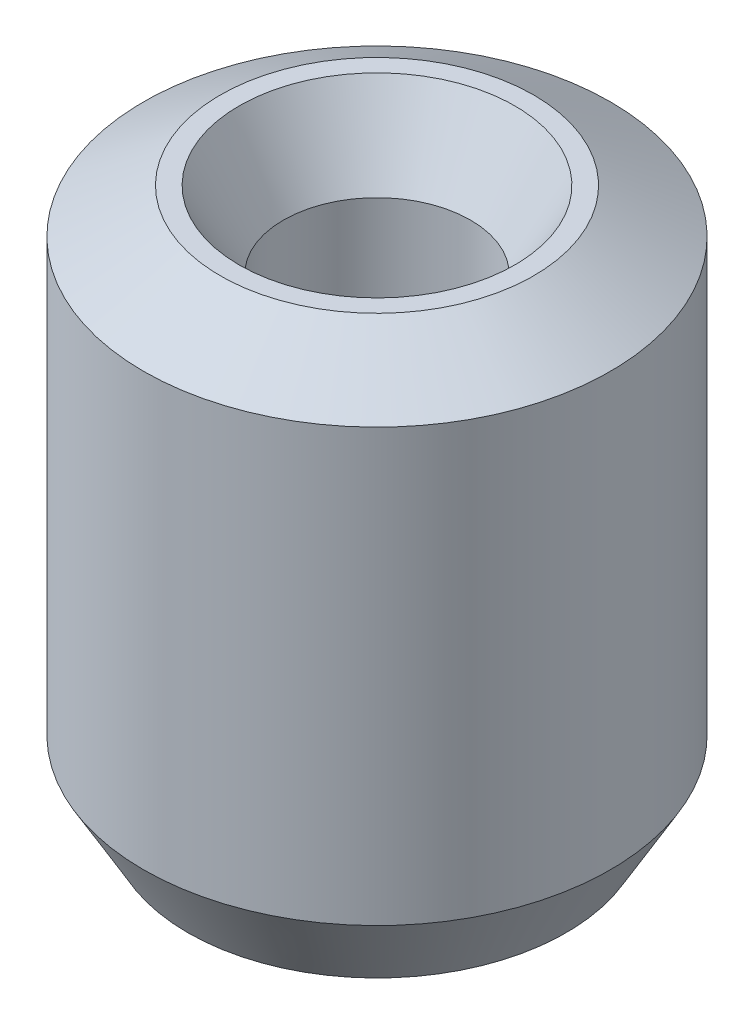
ISO-10303-21;
HEADER;
FILE_DESCRIPTION(('STEP AP214'),'2;1');
FILE_NAME('part.step','',(''),(''),'','','');
FILE_SCHEMA(('AUTOMOTIVE_DESIGN { 1 0 10303 214 1 1 1 1 }'));
ENDSEC;
DATA;
#1=APPLICATION_CONTEXT('core data for automotive mechanical design processes');
#2=APPLICATION_PROTOCOL_DEFINITION('international standard','automotive_design',2000,#1);
#3=PRODUCT_CONTEXT('',#1,'mechanical');
#4=PRODUCT('Part','Part','',(#3));
#5=PRODUCT_RELATED_PRODUCT_CATEGORY('part','',(#4));
#6=PRODUCT_DEFINITION_FORMATION('','',#4);
#7=PRODUCT_DEFINITION_CONTEXT('part definition',#1,'design');
#8=PRODUCT_DEFINITION('design','',#6,#7);
#9=PRODUCT_DEFINITION_SHAPE('','',#8);
#10=(LENGTH_UNIT() NAMED_UNIT(*) SI_UNIT(.MILLI.,.METRE.));
#11=(NAMED_UNIT(*) PLANE_ANGLE_UNIT() SI_UNIT($,.RADIAN.));
#12=(NAMED_UNIT(*) SI_UNIT($,.STERADIAN.) SOLID_ANGLE_UNIT());
#13=UNCERTAINTY_MEASURE_WITH_UNIT(LENGTH_MEASURE(1.E-05),#10,'distance_accuracy_value','');
#14=(GEOMETRIC_REPRESENTATION_CONTEXT(3) GLOBAL_UNCERTAINTY_ASSIGNED_CONTEXT((#13)) GLOBAL_UNIT_ASSIGNED_CONTEXT((#10,
#11,#12)) REPRESENTATION_CONTEXT('',''));
#15=CARTESIAN_POINT('',(0.,0.,0.));
#16=DIRECTION('',(0.,0.,1.));
#17=DIRECTION('',(1.,0.,0.));
#18=AXIS2_PLACEMENT_3D('',#15,#16,#17);
#19=CARTESIAN_POINT('',(0.,23.6784425008133,0.));
#20=DIRECTION('',(0.,-1.,0.));
#21=DIRECTION('',(0.,0.,-1.));
#22=AXIS2_PLACEMENT_3D('',#19,#20,#21);
#23=CYLINDRICAL_SURFACE('',#22,10.);
#24=CARTESIAN_POINT('',(0.,3.28796178943945,0.));
#25=DIRECTION('',(0.,1.,0.));
#26=DIRECTION('',(0.,0.,1.));
#27=AXIS2_PLACEMENT_3D('',#24,#25,#26);
#28=CIRCLE('',#27,10.);
#29=CARTESIAN_POINT('',(0.,3.28796178943945,-10.));
#30=VERTEX_POINT('',#29);
#31=EDGE_CURVE('E10',#30,#30,#28,.T.);
#32=CARTESIAN_POINT('',(0.,21.7801368765953,0.));
#33=DIRECTION('',(0.,1.,0.));
#34=DIRECTION('',(0.,0.,1.));
#35=AXIS2_PLACEMENT_3D('',#32,#33,#34);
#36=CIRCLE('',#35,10.);
#37=CARTESIAN_POINT('',(0.,21.7801368765953,-10.));
#38=VERTEX_POINT('',#37);
#39=EDGE_CURVE('E50',#38,#38,#36,.F.);
#40=CARTESIAN_POINT('',(0.,3.28796178943945,-10.));
#41=CARTESIAN_POINT('',(0.,3.48058861326399,-10.));
#42=CARTESIAN_POINT('',(0.,3.67321543708853,-10.));
#43=CARTESIAN_POINT('',(0.,4.05846908473761,-10.));
#44=CARTESIAN_POINT('',(0.,4.25109590856215,-10.));
#45=CARTESIAN_POINT('',(0.,4.63634955621123,-10.));
#46=CARTESIAN_POINT('',(0.,4.82897638003577,-10.));
#47=CARTESIAN_POINT('',(0.,5.21423002768485,-10.));
#48=CARTESIAN_POINT('',(0.,5.40685685150939,-10.));
#49=CARTESIAN_POINT('',(0.,5.79211049915847,-10.));
#50=CARTESIAN_POINT('',(0.,5.98473732298301,-10.));
#51=CARTESIAN_POINT('',(0.,6.36999097063209,-10.));
#52=CARTESIAN_POINT('',(0.,6.56261779445663,-10.));
#53=CARTESIAN_POINT('',(0.,6.94787144210571,-10.));
#54=CARTESIAN_POINT('',(0.,7.14049826593025,-10.));
#55=CARTESIAN_POINT('',(0.,7.52575191357933,-10.));
#56=CARTESIAN_POINT('',(0.,7.71837873740387,-10.));
#57=CARTESIAN_POINT('',(0.,8.10363238505295,-10.));
#58=CARTESIAN_POINT('',(0.,8.29625920887749,-10.));
#59=CARTESIAN_POINT('',(0.,8.68151285652656,-10.));
#60=CARTESIAN_POINT('',(0.,8.8741396803511,-10.));
#61=CARTESIAN_POINT('',(0.,9.25939332800018,-10.));
#62=CARTESIAN_POINT('',(0.,9.45202015182472,-10.));
#63=CARTESIAN_POINT('',(0.,9.83727379947381,-10.));
#64=CARTESIAN_POINT('',(0.,10.0299006232983,-10.));
#65=CARTESIAN_POINT('',(0.,10.4151542709474,-10.));
#66=CARTESIAN_POINT('',(0.,10.607781094772,-10.));
#67=CARTESIAN_POINT('',(0.,10.993034742421,-10.));
#68=CARTESIAN_POINT('',(0.,11.1856615662456,-10.));
#69=CARTESIAN_POINT('',(0.,11.5709152138947,-10.));
#70=CARTESIAN_POINT('',(0.,11.7635420377192,-10.));
#71=CARTESIAN_POINT('',(0.,12.1487956853683,-10.));
#72=CARTESIAN_POINT('',(0.,12.3414225091928,-10.));
#73=CARTESIAN_POINT('',(0.,12.7266761568419,-10.));
#74=CARTESIAN_POINT('',(0.,12.9193029806664,-10.));
#75=CARTESIAN_POINT('',(0.,13.3045566283155,-10.));
#76=CARTESIAN_POINT('',(0.,13.4971834521401,-10.));
#77=CARTESIAN_POINT('',(0.,13.8824370997891,-10.));
#78=CARTESIAN_POINT('',(0.,14.0750639236137,-10.));
#79=CARTESIAN_POINT('',(0.,14.4603175712628,-10.));
#80=CARTESIAN_POINT('',(0.,14.6529443950873,-10.));
#81=CARTESIAN_POINT('',(0.,15.0381980427364,-10.));
#82=CARTESIAN_POINT('',(0.,15.2308248665609,-10.));
#83=CARTESIAN_POINT('',(0.,15.61607851421,-10.));
#84=CARTESIAN_POINT('',(0.,15.8087053380345,-10.));
#85=CARTESIAN_POINT('',(0.,16.1939589856836,-10.));
#86=CARTESIAN_POINT('',(0.,16.3865858095082,-10.));
#87=CARTESIAN_POINT('',(0.,16.7718394571572,-10.));
#88=CARTESIAN_POINT('',(0.,16.9644662809818,-10.));
#89=CARTESIAN_POINT('',(0.,17.3497199286309,-10.));
#90=CARTESIAN_POINT('',(0.,17.5423467524554,-10.));
#91=CARTESIAN_POINT('',(0.,17.9276004001045,-10.));
#92=CARTESIAN_POINT('',(0.,18.120227223929,-10.));
#93=CARTESIAN_POINT('',(0.,18.5054808715781,-10.));
#94=CARTESIAN_POINT('',(0.,18.6981076954026,-10.));
#95=CARTESIAN_POINT('',(0.,19.0833613430517,-10.));
#96=CARTESIAN_POINT('',(0.,19.2759881668763,-10.));
#97=CARTESIAN_POINT('',(0.,19.6612418145253,-10.));
#98=CARTESIAN_POINT('',(0.,19.8538686383499,-10.));
#99=CARTESIAN_POINT('',(0.,20.239122285999,-10.));
#100=CARTESIAN_POINT('',(0.,20.4317491098235,-10.));
#101=CARTESIAN_POINT('',(0.,20.8170027574726,-10.));
#102=CARTESIAN_POINT('',(0.,21.0096295812971,-10.));
#103=CARTESIAN_POINT('',(0.,21.3948832289462,-10.));
#104=CARTESIAN_POINT('',(0.,21.5875100527707,-10.));
#105=CARTESIAN_POINT('',(0.,21.7801368765953,-10.));
#106=B_SPLINE_CURVE_WITH_KNOTS('',3,(#40,#41,#42,#43,#44,#45,#46,#47,#48,#49,#50,#51,#52,#53,
#54,#55,#56,#57,#58,#59,#60,#61,#62,#63,#64,#65,#66,#67,#68,#69,#70,#71,#72,#73,#74,#75,#76,#77,
#78,#79,#80,#81,#82,#83,#84,#85,#86,#87,#88,#89,#90,#91,#92,#93,#94,#95,#96,#97,#98,#99,#100,
#101,#102,#103,#104,#105),.UNSPECIFIED.,.F.,.F.,(4,2,2,2,2,2,2,2,2,2,2,2,2,2,2,2,2,2,2,2,2,2,2,
2,2,2,2,2,2,2,2,2,4),(0.,0.57788047147362,1.15576094294724,1.73364141442086,2.31152188589448,
2.8894023573681,3.46728282884172,4.04516330031534,4.62304377178896,5.20092424326258,
5.7788047147362,6.35668518620982,6.93456565768344,7.51244612915706,8.09032660063068,
8.6682070721043,9.24608754357792,9.82396801505154,10.4018484865252,10.9797289579988,
11.5576094294724,12.135489900946,12.7133703724196,13.2912508438933,13.8691313153669,
14.4470117868405,15.0248922583141,15.6027727297877,16.1806532012614,16.758533672735,
17.3364141442086,17.9142946156822,18.4921750871558),.UNSPECIFIED.);
#107=EDGE_CURVE('BSEAM39',#30,#38,#106,.T.);
#108=ORIENTED_EDGE('',*,*,#31,.T.);
#109=ORIENTED_EDGE('',*,*,#39,.T.);
#110=ORIENTED_EDGE('',*,*,#107,.T.);
#111=ORIENTED_EDGE('',*,*,#107,.F.);
#112=EDGE_LOOP('',(#108,#110,#109,#111));
#113=FACE_BOUND('',#112,.T.);
#114=ADVANCED_FACE('F39',(#113),#23,.T.);
#115=CARTESIAN_POINT('',(0.,23.6784425008133,0.));
#116=DIRECTION('',(0.,1.,0.));
#117=DIRECTION('',(0.,0.,1.));
#118=AXIS2_PLACEMENT_3D('',#115,#116,#117);
#119=PLANE('',#118);
#120=CARTESIAN_POINT('',(0.,23.6784425008133,0.));
#121=DIRECTION('',(0.,1.,0.));
#122=DIRECTION('',(0.,0.,1.));
#123=AXIS2_PLACEMENT_3D('',#120,#121,#122);
#124=CIRCLE('',#123,5.90508329491844);
#125=CARTESIAN_POINT('',(0.,23.6784425008133,5.90508329491844));
#126=VERTEX_POINT('',#125);
#127=EDGE_CURVE('E58',#126,#126,#124,.F.);
#128=ORIENTED_EDGE('',*,*,#127,.T.);
#129=EDGE_LOOP('',(#128));
#130=FACE_BOUND('',#129,.T.);
#131=CARTESIAN_POINT('',(0.,23.6784425008133,0.));
#132=DIRECTION('',(0.,1.,0.));
#133=DIRECTION('',(0.,0.,1.));
#134=AXIS2_PLACEMENT_3D('',#131,#132,#133);
#135=CIRCLE('',#134,6.71203821056063);
#136=CARTESIAN_POINT('',(0.,23.6784425008133,-6.71203821056063));
#137=VERTEX_POINT('',#136);
#138=EDGE_CURVE('E61',#137,#137,#135,.T.);
#139=ORIENTED_EDGE('',*,*,#138,.T.);
#140=EDGE_LOOP('',(#139));
#141=FACE_BOUND('',#140,.T.);
#142=ADVANCED_FACE('F88',(#130,#141),#119,.T.);
#143=CARTESIAN_POINT('',(0.,0.,0.));
#144=DIRECTION('',(0.,1.,0.));
#145=DIRECTION('',(0.,0.,1.));
#146=AXIS2_PLACEMENT_3D('',#143,#144,#145);
#147=PLANE('',#146);
#148=CARTESIAN_POINT('',(0.,0.,0.));
#149=DIRECTION('',(0.,1.,0.));
#150=DIRECTION('',(0.,0.,1.));
#151=AXIS2_PLACEMENT_3D('',#148,#149,#150);
#152=CIRCLE('',#151,7.29473946013972);
#153=CARTESIAN_POINT('',(0.,0.,7.29473946013972));
#154=VERTEX_POINT('',#153);
#155=EDGE_CURVE('E51',#154,#154,#152,.T.);
#156=ORIENTED_EDGE('',*,*,#155,.T.);
#157=EDGE_LOOP('',(#156));
#158=FACE_BOUND('',#157,.T.);
#159=CARTESIAN_POINT('',(0.,0.,0.));
#160=DIRECTION('',(0.,1.,0.));
#161=DIRECTION('',(0.,0.,1.));
#162=AXIS2_PLACEMENT_3D('',#159,#160,#161);
#163=CIRCLE('',#162,8.10169437578192);
#164=CARTESIAN_POINT('',(0.,0.,8.10169437578192));
#165=VERTEX_POINT('',#164);
#166=EDGE_CURVE('E54',#165,#165,#163,.F.);
#167=ORIENTED_EDGE('',*,*,#166,.T.);
#168=EDGE_LOOP('',(#167));
#169=FACE_BOUND('',#168,.T.);
#170=ADVANCED_FACE('F83',(#158,#169),#147,.F.);
#171=CARTESIAN_POINT('',(0.,23.6784425008133,0.));
#172=DIRECTION('',(0.,-1.,0.));
#173=DIRECTION('',(0.,0.,-1.));
#174=AXIS2_PLACEMENT_3D('',#171,#172,#173);
#175=CYLINDRICAL_SURFACE('',#174,4.00677767070036);
#176=CARTESIAN_POINT('',(0.,20.3904807113739,0.));
#177=DIRECTION('',(0.,1.,0.));
#178=DIRECTION('',(0.,0.,1.));
#179=AXIS2_PLACEMENT_3D('',#176,#177,#178);
#180=CIRCLE('',#179,4.00677767070036);
#181=CARTESIAN_POINT('',(0.,20.3904807113739,-4.00677767070036));
#182=VERTEX_POINT('',#181);
#183=EDGE_CURVE('E67',#182,#182,#180,.T.);
#184=CARTESIAN_POINT('',(0.,1.89830562421804,0.));
#185=DIRECTION('',(0.,1.,0.));
#186=DIRECTION('',(0.,0.,1.));
#187=AXIS2_PLACEMENT_3D('',#184,#185,#186);
#188=CIRCLE('',#187,4.00677767070036);
#189=CARTESIAN_POINT('',(0.,1.89830562421804,-4.00677767070036));
#190=VERTEX_POINT('',#189);
#191=EDGE_CURVE('E69',#190,#190,#188,.F.);
#192=CARTESIAN_POINT('',(0.,20.3904807113739,-4.00677767070036));
#193=CARTESIAN_POINT('',(0.,20.1978538875494,-4.00677767070036));
#194=CARTESIAN_POINT('',(0.,20.0052270637248,-4.00677767070036));
#195=CARTESIAN_POINT('',(0.,19.6199734160757,-4.00677767070036));
#196=CARTESIAN_POINT('',(0.,19.4273465922512,-4.00677767070036));
#197=CARTESIAN_POINT('',(0.,19.0420929446021,-4.00677767070036));
#198=CARTESIAN_POINT('',(0.,18.8494661207776,-4.00677767070036));
#199=CARTESIAN_POINT('',(0.,18.4642124731285,-4.00677767070036));
#200=CARTESIAN_POINT('',(0.,18.271585649304,-4.00677767070036));
#201=CARTESIAN_POINT('',(0.,17.8863320016549,-4.00677767070036));
#202=CARTESIAN_POINT('',(0.,17.6937051778303,-4.00677767070036));
#203=CARTESIAN_POINT('',(0.,17.3084515301813,-4.00677767070036));
#204=CARTESIAN_POINT('',(0.,17.1158247063567,-4.00677767070036));
#205=CARTESIAN_POINT('',(0.,16.7305710587076,-4.00677767070036));
#206=CARTESIAN_POINT('',(0.,16.5379442348831,-4.00677767070036));
#207=CARTESIAN_POINT('',(0.,16.152690587234,-4.00677767070036));
#208=CARTESIAN_POINT('',(0.,15.9600637634095,-4.00677767070036));
#209=CARTESIAN_POINT('',(0.,15.5748101157604,-4.00677767070036));
#210=CARTESIAN_POINT('',(0.,15.3821832919359,-4.00677767070036));
#211=CARTESIAN_POINT('',(0.,14.9969296442868,-4.00677767070036));
#212=CARTESIAN_POINT('',(0.,14.8043028204622,-4.00677767070036));
#213=CARTESIAN_POINT('',(0.,14.4190491728132,-4.00677767070036));
#214=CARTESIAN_POINT('',(0.,14.2264223489886,-4.00677767070036));
#215=CARTESIAN_POINT('',(0.,13.8411687013395,-4.00677767070036));
#216=CARTESIAN_POINT('',(0.,13.648541877515,-4.00677767070036));
#217=CARTESIAN_POINT('',(0.,13.2632882298659,-4.00677767070036));
#218=CARTESIAN_POINT('',(0.,13.0706614060414,-4.00677767070036));
#219=CARTESIAN_POINT('',(0.,12.6854077583923,-4.00677767070036));
#220=CARTESIAN_POINT('',(0.,12.4927809345677,-4.00677767070036));
#221=CARTESIAN_POINT('',(0.,12.1075272869187,-4.00677767070036));
#222=CARTESIAN_POINT('',(0.,11.9149004630941,-4.00677767070036));
#223=CARTESIAN_POINT('',(0.,11.529646815445,-4.00677767070036));
#224=CARTESIAN_POINT('',(0.,11.3370199916205,-4.00677767070036));
#225=CARTESIAN_POINT('',(0.,10.9517663439714,-4.00677767070036));
#226=CARTESIAN_POINT('',(0.,10.7591395201469,-4.00677767070036));
#227=CARTESIAN_POINT('',(0.,10.3738858724978,-4.00677767070036));
#228=CARTESIAN_POINT('',(0.,10.1812590486733,-4.00677767070036));
#229=CARTESIAN_POINT('',(0.,9.79600540102419,-4.00677767070036));
#230=CARTESIAN_POINT('',(0.,9.60337857719965,-4.00677767070036));
#231=CARTESIAN_POINT('',(0.,9.21812492955056,-4.00677767070036));
#232=CARTESIAN_POINT('',(0.,9.02549810572602,-4.00677767070036));
#233=CARTESIAN_POINT('',(0.,8.64024445807694,-4.00677767070036));
#234=CARTESIAN_POINT('',(0.,8.4476176342524,-4.00677767070036));
#235=CARTESIAN_POINT('',(0.,8.06236398660332,-4.00677767070036));
#236=CARTESIAN_POINT('',(0.,7.86973716277878,-4.00677767070036));
#237=CARTESIAN_POINT('',(0.,7.4844835151297,-4.00677767070036));
#238=CARTESIAN_POINT('',(0.,7.29185669130516,-4.00677767070036));
#239=CARTESIAN_POINT('',(0.,6.90660304365608,-4.00677767070036));
#240=CARTESIAN_POINT('',(0.,6.71397621983154,-4.00677767070036));
#241=CARTESIAN_POINT('',(0.,6.32872257218246,-4.00677767070036));
#242=CARTESIAN_POINT('',(0.,6.13609574835792,-4.00677767070036));
#243=CARTESIAN_POINT('',(0.,5.75084210070884,-4.00677767070036));
#244=CARTESIAN_POINT('',(0.,5.5582152768843,-4.00677767070036));
#245=CARTESIAN_POINT('',(0.,5.17296162923522,-4.00677767070036));
#246=CARTESIAN_POINT('',(0.,4.98033480541068,-4.00677767070036));
#247=CARTESIAN_POINT('',(0.,4.5950811577616,-4.00677767070036));
#248=CARTESIAN_POINT('',(0.,4.40245433393706,-4.00677767070036));
#249=CARTESIAN_POINT('',(0.,4.01720068628798,-4.00677767070036));
#250=CARTESIAN_POINT('',(0.,3.82457386246344,-4.00677767070036));
#251=CARTESIAN_POINT('',(0.,3.43932021481436,-4.00677767070036));
#252=CARTESIAN_POINT('',(0.,3.24669339098982,-4.00677767070036));
#253=CARTESIAN_POINT('',(0.,2.86143974334074,-4.00677767070036));
#254=CARTESIAN_POINT('',(0.,2.6688129195162,-4.00677767070036));
#255=CARTESIAN_POINT('',(0.,2.28355927186712,-4.00677767070036));
#256=CARTESIAN_POINT('',(0.,2.09093244804258,-4.00677767070036));
#257=CARTESIAN_POINT('',(0.,1.89830562421804,-4.00677767070036));
#258=B_SPLINE_CURVE_WITH_KNOTS('',3,(#192,#193,#194,#195,#196,#197,#198,#199,#200,#201,#202,
#203,#204,#205,#206,#207,#208,#209,#210,#211,#212,#213,#214,#215,#216,#217,#218,#219,#220,#221,
#222,#223,#224,#225,#226,#227,#228,#229,#230,#231,#232,#233,#234,#235,#236,#237,#238,#239,#240,
#241,#242,#243,#244,#245,#246,#247,#248,#249,#250,#251,#252,#253,#254,#255,#256,#257),
.UNSPECIFIED.,.F.,.F.,(4,2,2,2,2,2,2,2,2,2,2,2,2,2,2,2,2,2,2,2,2,2,2,2,2,2,2,2,2,2,2,2,4),(0.,
0.577880471473623,1.15576094294724,1.73364141442086,2.31152188589448,2.8894023573681,
3.46728282884172,4.04516330031534,4.62304377178896,5.20092424326258,5.77880471473621,
6.35668518620983,6.93456565768345,7.51244612915707,8.09032660063069,8.66820707210431,
9.24608754357793,9.82396801505155,10.4018484865252,10.9797289579988,11.5576094294724,
12.135489900946,12.7133703724197,13.2912508438933,13.8691313153669,14.4470117868405,
15.0248922583141,15.6027727297878,16.1806532012614,16.758533672735,17.3364141442086,
17.9142946156822,18.4921750871559),.UNSPECIFIED.);
#259=EDGE_CURVE('BSEAM71',#182,#190,#258,.T.);
#260=ORIENTED_EDGE('',*,*,#183,.T.);
#261=ORIENTED_EDGE('',*,*,#191,.T.);
#262=ORIENTED_EDGE('',*,*,#259,.T.);
#263=ORIENTED_EDGE('',*,*,#259,.F.);
#264=EDGE_LOOP('',(#260,#262,#261,#263));
#265=FACE_BOUND('',#264,.T.);
#266=ADVANCED_FACE('F71',(#265),#175,.F.);
#267=CARTESIAN_POINT('',(0.,20.3904807113739,0.));
#268=DIRECTION('',(0.,1.,0.));
#269=DIRECTION('',(0.,0.,1.));
#270=AXIS2_PLACEMENT_3D('',#267,#268,#269);
#271=CONICAL_SURFACE('',#270,4.00677767070036,0.523598775598303);
#272=ORIENTED_EDGE('',*,*,#127,.F.);
#273=EDGE_LOOP('',(#272));
#274=FACE_BOUND('',#273,.T.);
#275=ORIENTED_EDGE('',*,*,#183,.F.);
#276=EDGE_LOOP('',(#275));
#277=FACE_BOUND('',#276,.T.);
#278=ADVANCED_FACE('F77',(#274,#277),#271,.F.);
#279=CARTESIAN_POINT('',(0.,0.,0.));
#280=DIRECTION('',(0.,-1.,0.));
#281=DIRECTION('',(0.,0.,-1.));
#282=AXIS2_PLACEMENT_3D('',#279,#280,#281);
#283=CONICAL_SURFACE('',#282,7.29473946013972,1.04719755119659);
#284=ORIENTED_EDGE('',*,*,#191,.F.);
#285=EDGE_LOOP('',(#284));
#286=FACE_BOUND('',#285,.T.);
#287=ORIENTED_EDGE('',*,*,#155,.F.);
#288=EDGE_LOOP('',(#287));
#289=FACE_BOUND('',#288,.T.);
#290=ADVANCED_FACE('F73',(#286,#289),#283,.F.);
#291=CARTESIAN_POINT('',(0.,3.28796178943944,0.));
#292=DIRECTION('',(0.,1.,0.));
#293=DIRECTION('',(0.,0.,1.));
#294=AXIS2_PLACEMENT_3D('',#291,#292,#293);
#295=CONICAL_SURFACE('',#294,10.,0.523598775598302);
#296=ORIENTED_EDGE('',*,*,#166,.F.);
#297=EDGE_LOOP('',(#296));
#298=FACE_BOUND('',#297,.T.);
#299=ORIENTED_EDGE('',*,*,#31,.F.);
#300=EDGE_LOOP('',(#299));
#301=FACE_BOUND('',#300,.T.);
#302=ADVANCED_FACE('F76',(#298,#301),#295,.T.);
#303=CARTESIAN_POINT('',(0.,23.6784425008133,0.));
#304=DIRECTION('',(0.,-1.,0.));
#305=DIRECTION('',(0.,0.,-1.));
#306=AXIS2_PLACEMENT_3D('',#303,#304,#305);
#307=CONICAL_SURFACE('',#306,6.71203821056063,1.04719755119659);
#308=CARTESIAN_POINT('',(0.,21.7801368765953,-10.));
#309=CARTESIAN_POINT('',(0.,21.7999108935142,-9.96575039802668));
#310=CARTESIAN_POINT('',(0.,21.8196849104332,-9.93150079605335));
#311=CARTESIAN_POINT('',(0.,21.859232944271,-9.8630015921067));
#312=CARTESIAN_POINT('',(0.,21.87900696119,-9.82875199013337));
#313=CARTESIAN_POINT('',(0.,21.9185549950279,-9.76025278618672));
#314=CARTESIAN_POINT('',(0.,21.9383290119468,-9.72600318421339));
#315=CARTESIAN_POINT('',(0.,21.9778770457847,-9.65750398026674));
#316=CARTESIAN_POINT('',(0.,21.9976510627036,-9.62325437829341));
#317=CARTESIAN_POINT('',(0.,22.0371990965415,-9.55475517434676));
#318=CARTESIAN_POINT('',(0.,22.0569731134604,-9.52050557237343));
#319=CARTESIAN_POINT('',(0.,22.0965211472983,-9.45200636842678));
#320=CARTESIAN_POINT('',(0.,22.1162951642172,-9.41775676645345));
#321=CARTESIAN_POINT('',(0.,22.1558431980551,-9.3492575625068));
#322=CARTESIAN_POINT('',(0.,22.175617214974,-9.31500796053347));
#323=CARTESIAN_POINT('',(0.,22.2151652488119,-9.24650875658682));
#324=CARTESIAN_POINT('',(0.,22.2349392657309,-9.21225915461349));
#325=CARTESIAN_POINT('',(0.,22.2744872995687,-9.14375995066684));
#326=CARTESIAN_POINT('',(0.,22.2942613164877,-9.10951034869351));
#327=CARTESIAN_POINT('',(0.,22.3338093503255,-9.04101114474685));
#328=CARTESIAN_POINT('',(0.,22.3535833672445,-9.00676154277353));
#329=CARTESIAN_POINT('',(0.,22.3931314010824,-8.93826233882687));
#330=CARTESIAN_POINT('',(0.,22.4129054180013,-8.90401273685355));
#331=CARTESIAN_POINT('',(0.,22.4524534518392,-8.83551353290689));
#332=CARTESIAN_POINT('',(0.,22.4722274687581,-8.80126393093357));
#333=CARTESIAN_POINT('',(0.,22.511775502596,-8.73276472698691));
#334=CARTESIAN_POINT('',(0.,22.5315495195149,-8.69851512501359));
#335=CARTESIAN_POINT('',(0.,22.5710975533528,-8.63001592106693));
#336=CARTESIAN_POINT('',(0.,22.5908715702717,-8.59576631909361));
#337=CARTESIAN_POINT('',(0.,22.6304196041096,-8.52726711514695));
#338=CARTESIAN_POINT('',(0.,22.6501936210286,-8.49301751317362));
#339=CARTESIAN_POINT('',(0.,22.6897416548664,-8.42451830922697));
#340=CARTESIAN_POINT('',(0.,22.7095156717854,-8.39026870725364));
#341=CARTESIAN_POINT('',(0.,22.7490637056232,-8.32176950330699));
#342=CARTESIAN_POINT('',(0.,22.7688377225422,-8.28751990133366));
#343=CARTESIAN_POINT('',(0.,22.8083857563801,-8.21902069738701));
#344=CARTESIAN_POINT('',(0.,22.828159773299,-8.18477109541368));
#345=CARTESIAN_POINT('',(0.,22.8677078071369,-8.11627189146703));
#346=CARTESIAN_POINT('',(0.,22.8874818240558,-8.0820222894937));
#347=CARTESIAN_POINT('',(0.,22.9270298578937,-8.01352308554705));
#348=CARTESIAN_POINT('',(0.,22.9468038748126,-7.97927348357372));
#349=CARTESIAN_POINT('',(0.,22.9863519086505,-7.91077427962707));
#350=CARTESIAN_POINT('',(0.,23.0061259255694,-7.87652467765374));
#351=CARTESIAN_POINT('',(0.,23.0456739594073,-7.80802547370709));
#352=CARTESIAN_POINT('',(0.,23.0654479763263,-7.77377587173376));
#353=CARTESIAN_POINT('',(0.,23.1049960101641,-7.70527666778711));
#354=CARTESIAN_POINT('',(0.,23.1247700270831,-7.67102706581378));
#355=CARTESIAN_POINT('',(0.,23.1643180609209,-7.60252786186713));
#356=CARTESIAN_POINT('',(0.,23.1840920778399,-7.5682782598938));
#357=CARTESIAN_POINT('',(0.,23.2236401116778,-7.49977905594715));
#358=CARTESIAN_POINT('',(0.,23.2434141285967,-7.46552945397382));
#359=CARTESIAN_POINT('',(0.,23.2829621624346,-7.39703025002717));
#360=CARTESIAN_POINT('',(0.,23.3027361793535,-7.36278064805384));
#361=CARTESIAN_POINT('',(0.,23.3422842131914,-7.29428144410718));
#362=CARTESIAN_POINT('',(0.,23.3620582301103,-7.26003184213386));
#363=CARTESIAN_POINT('',(0.,23.4016062639482,-7.19153263818721));
#364=CARTESIAN_POINT('',(0.,23.4213802808671,-7.15728303621388));
#365=CARTESIAN_POINT('',(0.,23.460928314705,-7.08878383226722));
#366=CARTESIAN_POINT('',(0.,23.4807023316239,-7.0545342302939));
#367=CARTESIAN_POINT('',(0.,23.5202503654618,-6.98603502634724));
#368=CARTESIAN_POINT('',(0.,23.5400243823808,-6.95178542437392));
#369=CARTESIAN_POINT('',(0.,23.5795724162186,-6.88328622042726));
#370=CARTESIAN_POINT('',(0.,23.5993464331376,-6.84903661845394));
#371=CARTESIAN_POINT('',(0.,23.6388944669755,-6.78053741450728));
#372=CARTESIAN_POINT('',(0.,23.6586684838944,-6.74628781253396));
#373=CARTESIAN_POINT('',(0.,23.6784425008133,-6.71203821056063));
#374=B_SPLINE_CURVE_WITH_KNOTS('',3,(#308,#309,#310,#311,#312,#313,#314,#315,#316,#317,#318,
#319,#320,#321,#322,#323,#324,#325,#326,#327,#328,#329,#330,#331,#332,#333,#334,#335,#336,#337,
#338,#339,#340,#341,#342,#343,#344,#345,#346,#347,#348,#349,#350,#351,#352,#353,#354,#355,#356,
#357,#358,#359,#360,#361,#362,#363,#364,#365,#366,#367,#368,#369,#370,#371,#372,#373),
.UNSPECIFIED.,.F.,.F.,(4,2,2,2,2,2,2,2,2,2,2,2,2,2,2,2,2,2,2,2,2,2,2,2,2,2,2,2,2,2,2,2,4),(0.,
0.118644101513627,0.237288203027253,0.355932304540882,0.474576406054508,0.593220507568135,
0.711864609081762,0.830508710595388,0.949152812109015,1.06779691362264,1.18644101513627,
1.3050851166499,1.42372921816352,1.54237331967715,1.66101742119078,1.7796615227044,
1.89830562421803,2.01694972573166,2.13559382724528,2.25423792875891,2.37288203027254,
2.49152613178617,2.61017023329979,2.72881433481342,2.84745843632705,2.96610253784067,
3.0847466393543,3.20339074086793,3.32203484238156,3.44067894389518,3.55932304540881,
3.67796714692244,3.79661124843606),.UNSPECIFIED.);
#375=EDGE_CURVE('BSEAM45',#38,#137,#374,.T.);
#376=ORIENTED_EDGE('',*,*,#39,.F.);
#377=ORIENTED_EDGE('',*,*,#138,.F.);
#378=ORIENTED_EDGE('',*,*,#375,.T.);
#379=ORIENTED_EDGE('',*,*,#375,.F.);
#380=EDGE_LOOP('',(#376,#378,#377,#379));
#381=FACE_BOUND('',#380,.T.);
#382=ADVANCED_FACE('F45',(#381),#307,.T.);
#383=CLOSED_SHELL('',(#114,#142,#170,#266,#278,#290,#302,#382));
#384=MANIFOLD_SOLID_BREP('B2',#383);
#385=ADVANCED_BREP_SHAPE_REPRESENTATION('',(#18,#384),#14);
#386=SHAPE_DEFINITION_REPRESENTATION(#9,#385);
ENDSEC;
END-ISO-10303-21;
